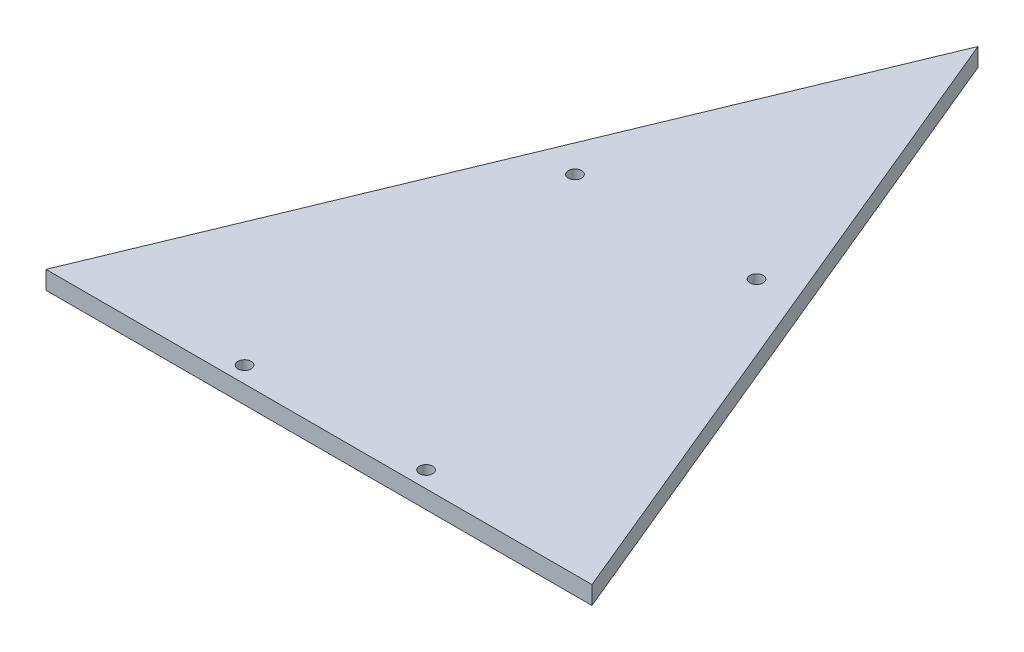
ISO-10303-21;
HEADER;
FILE_DESCRIPTION(('STEP AP214'),'2;1');
FILE_NAME('part.step','',(''),(''),'','','');
FILE_SCHEMA(('AUTOMOTIVE_DESIGN { 1 0 10303 214 1 1 1 1 }'));
ENDSEC;
DATA;
#1=APPLICATION_CONTEXT('core data for automotive mechanical design processes');
#2=APPLICATION_PROTOCOL_DEFINITION('international standard','automotive_design',2000,#1);
#3=PRODUCT_CONTEXT('',#1,'mechanical');
#4=PRODUCT('Part','Part','',(#3));
#5=PRODUCT_RELATED_PRODUCT_CATEGORY('part','',(#4));
#6=PRODUCT_DEFINITION_FORMATION('','',#4);
#7=PRODUCT_DEFINITION_CONTEXT('part definition',#1,'design');
#8=PRODUCT_DEFINITION('design','',#6,#7);
#9=PRODUCT_DEFINITION_SHAPE('','',#8);
#10=(LENGTH_UNIT() NAMED_UNIT(*) SI_UNIT(.MILLI.,.METRE.));
#11=(NAMED_UNIT(*) PLANE_ANGLE_UNIT() SI_UNIT($,.RADIAN.));
#12=(NAMED_UNIT(*) SI_UNIT($,.STERADIAN.) SOLID_ANGLE_UNIT());
#13=UNCERTAINTY_MEASURE_WITH_UNIT(LENGTH_MEASURE(1.E-05),#10,'distance_accuracy_value','');
#14=(GEOMETRIC_REPRESENTATION_CONTEXT(3) GLOBAL_UNCERTAINTY_ASSIGNED_CONTEXT((#13)) GLOBAL_UNIT_ASSIGNED_CONTEXT((#10,
#11,#12)) REPRESENTATION_CONTEXT('',''));
#15=CARTESIAN_POINT('',(0.,0.,0.));
#16=DIRECTION('',(0.,0.,1.));
#17=DIRECTION('',(1.,0.,0.));
#18=AXIS2_PLACEMENT_3D('',#15,#16,#17);
#19=CARTESIAN_POINT('',(0.,5.,0.));
#20=DIRECTION('',(0.,0.,1.));
#21=DIRECTION('',(1.,0.,0.));
#22=AXIS2_PLACEMENT_3D('',#19,#20,#21);
#23=PLANE('',#22);
#24=DIRECTION('',(-1.,0.,0.));
#25=VECTOR('',#24,1.);
#26=CARTESIAN_POINT('',(0.,0.,0.));
#27=LINE('',#26,#25);
#28=CARTESIAN_POINT('',(75.1797615707155,0.,0.));
#29=VERTEX_POINT('',#28);
#30=CARTESIAN_POINT('',(-75.1797615707155,0.,0.));
#31=VERTEX_POINT('',#30);
#32=EDGE_CURVE('E83',#29,#31,#27,.T.);
#33=ORIENTED_EDGE('',*,*,#32,.F.);
#34=DIRECTION('',(0.,-1.,0.));
#35=VECTOR('',#34,1.);
#36=CARTESIAN_POINT('',(75.1797615707155,5.,0.));
#37=LINE('',#36,#35);
#38=CARTESIAN_POINT('',(75.1797615707155,5.,0.));
#39=VERTEX_POINT('',#38);
#40=EDGE_CURVE('E11',#39,#29,#37,.T.);
#41=ORIENTED_EDGE('',*,*,#40,.F.);
#42=DIRECTION('',(-1.,0.,0.));
#43=VECTOR('',#42,1.);
#44=CARTESIAN_POINT('',(0.,5.,0.));
#45=LINE('',#44,#43);
#46=CARTESIAN_POINT('',(-75.1797615707155,5.,0.));
#47=VERTEX_POINT('',#46);
#48=EDGE_CURVE('E81',#39,#47,#45,.T.);
#49=ORIENTED_EDGE('',*,*,#48,.T.);
#50=DIRECTION('',(0.,-1.,0.));
#51=VECTOR('',#50,1.);
#52=CARTESIAN_POINT('',(-75.1797615707155,5.,0.));
#53=LINE('',#52,#51);
#54=EDGE_CURVE('E63',#47,#31,#53,.T.);
#55=ORIENTED_EDGE('',*,*,#54,.T.);
#56=EDGE_LOOP('',(#33,#41,#49,#55));
#57=FACE_BOUND('',#56,.T.);
#58=ADVANCED_FACE('F44',(#57),#23,.T.);
#59=CARTESIAN_POINT('',(64.1699403926784,5.,-26.58005960732));
#60=DIRECTION('',(-0.923879532511289,0.,0.382683432365084));
#61=DIRECTION('',(0.382683432365084,0.,0.923879532511289));
#62=AXIS2_PLACEMENT_3D('',#59,#60,#61);
#63=PLANE('',#62);
#64=DIRECTION('',(-0.382683432365084,0.,-0.923879532511289));
#65=VECTOR('',#64,1.);
#66=CARTESIAN_POINT('',(64.1699403926784,0.,-26.58005960732));
#67=LINE('',#66,#65);
#68=CARTESIAN_POINT('',(0.,0.,-181.5));
#69=VERTEX_POINT('',#68);
#70=EDGE_CURVE('E99',#29,#69,#67,.T.);
#71=ORIENTED_EDGE('',*,*,#70,.T.);
#72=DIRECTION('',(0.,-1.,0.));
#73=VECTOR('',#72,1.);
#74=CARTESIAN_POINT('',(0.,5.,-181.5));
#75=LINE('',#74,#73);
#76=CARTESIAN_POINT('',(0.,5.,-181.5));
#77=VERTEX_POINT('',#76);
#78=EDGE_CURVE('E54',#77,#69,#75,.T.);
#79=ORIENTED_EDGE('',*,*,#78,.F.);
#80=DIRECTION('',(-0.382683432365084,0.,-0.923879532511289));
#81=VECTOR('',#80,1.);
#82=CARTESIAN_POINT('',(64.1699403926784,5.,-26.58005960732));
#83=LINE('',#82,#81);
#84=EDGE_CURVE('E86',#39,#77,#83,.T.);
#85=ORIENTED_EDGE('',*,*,#84,.F.);
#86=ORIENTED_EDGE('',*,*,#40,.T.);
#87=EDGE_LOOP('',(#71,#79,#85,#86));
#88=FACE_BOUND('',#87,.T.);
#89=ADVANCED_FACE('F87',(#88),#63,.F.);
#90=CARTESIAN_POINT('',(-64.1699403926784,5.,-26.58005960732));
#91=DIRECTION('',(-0.923879532511289,0.,-0.382683432365084));
#92=DIRECTION('',(-0.382683432365084,0.,0.923879532511289));
#93=AXIS2_PLACEMENT_3D('',#90,#91,#92);
#94=PLANE('',#93);
#95=DIRECTION('',(0.382683432365084,0.,-0.923879532511289));
#96=VECTOR('',#95,1.);
#97=CARTESIAN_POINT('',(-64.1699403926784,0.,-26.58005960732));
#98=LINE('',#97,#96);
#99=EDGE_CURVE('E94',#31,#69,#98,.T.);
#100=ORIENTED_EDGE('',*,*,#99,.F.);
#101=ORIENTED_EDGE('',*,*,#54,.F.);
#102=DIRECTION('',(0.382683432365084,0.,-0.923879532511289));
#103=VECTOR('',#102,1.);
#104=CARTESIAN_POINT('',(-64.1699403926784,5.,-26.58005960732));
#105=LINE('',#104,#103);
#106=EDGE_CURVE('E90',#47,#77,#105,.T.);
#107=ORIENTED_EDGE('',*,*,#106,.T.);
#108=ORIENTED_EDGE('',*,*,#78,.T.);
#109=EDGE_LOOP('',(#100,#101,#107,#108));
#110=FACE_BOUND('',#109,.T.);
#111=ADVANCED_FACE('F152',(#110),#94,.T.);
#112=CARTESIAN_POINT('',(0.,5.,0.));
#113=DIRECTION('',(0.,1.,0.));
#114=DIRECTION('',(0.,0.,1.));
#115=AXIS2_PLACEMENT_3D('',#112,#113,#114);
#116=PLANE('',#115);
#117=CARTESIAN_POINT('',(-25.,5.,-4.49999999999999));
#118=DIRECTION('',(0.,1.,0.));
#119=DIRECTION('',(0.,0.,1.));
#120=AXIS2_PLACEMENT_3D('',#117,#118,#119);
#121=CIRCLE('',#120,1.82500000000001);
#122=CARTESIAN_POINT('',(-25.,5.,-2.67499999999999));
#123=VERTEX_POINT('',#122);
#124=EDGE_CURVE('E178',#123,#123,#121,.T.);
#125=ORIENTED_EDGE('',*,*,#124,.F.);
#126=EDGE_LOOP('',(#125));
#127=FACE_BOUND('',#126,.T.);
#128=CARTESIAN_POINT('',(25.,5.,-95.5));
#129=DIRECTION('',(0.,1.,0.));
#130=DIRECTION('',(0.,0.,1.));
#131=AXIS2_PLACEMENT_3D('',#128,#129,#130);
#132=CIRCLE('',#131,1.82499999999999);
#133=CARTESIAN_POINT('',(25.,5.,-93.675));
#134=VERTEX_POINT('',#133);
#135=EDGE_CURVE('E181',#134,#134,#132,.T.);
#136=ORIENTED_EDGE('',*,*,#135,.F.);
#137=EDGE_LOOP('',(#136));
#138=FACE_BOUND('',#137,.T.);
#139=CARTESIAN_POINT('',(-25.,5.,-95.5));
#140=DIRECTION('',(0.,1.,0.));
#141=DIRECTION('',(0.,0.,1.));
#142=AXIS2_PLACEMENT_3D('',#139,#140,#141);
#143=CIRCLE('',#142,1.82500000000001);
#144=CARTESIAN_POINT('',(-25.,5.,-93.675));
#145=VERTEX_POINT('',#144);
#146=EDGE_CURVE('E187',#145,#145,#143,.T.);
#147=ORIENTED_EDGE('',*,*,#146,.F.);
#148=EDGE_LOOP('',(#147));
#149=FACE_BOUND('',#148,.T.);
#150=CARTESIAN_POINT('',(25.,5.,-4.49999999999999));
#151=DIRECTION('',(0.,1.,0.));
#152=DIRECTION('',(0.,0.,1.));
#153=AXIS2_PLACEMENT_3D('',#150,#151,#152);
#154=CIRCLE('',#153,1.82499999999999);
#155=CARTESIAN_POINT('',(25.,5.,-2.675));
#156=VERTEX_POINT('',#155);
#157=EDGE_CURVE('E102',#156,#156,#154,.T.);
#158=ORIENTED_EDGE('',*,*,#157,.F.);
#159=EDGE_LOOP('',(#158));
#160=FACE_BOUND('',#159,.T.);
#161=ORIENTED_EDGE('',*,*,#48,.F.);
#162=ORIENTED_EDGE('',*,*,#84,.T.);
#163=ORIENTED_EDGE('',*,*,#106,.F.);
#164=EDGE_LOOP('',(#161,#162,#163));
#165=FACE_BOUND('',#164,.T.);
#166=ADVANCED_FACE('F92',(#127,#138,#149,#160,#165),#116,.T.);
#167=CARTESIAN_POINT('',(0.,0.,0.));
#168=DIRECTION('',(0.,1.,0.));
#169=DIRECTION('',(0.,0.,1.));
#170=AXIS2_PLACEMENT_3D('',#167,#168,#169);
#171=PLANE('',#170);
#172=CARTESIAN_POINT('',(-25.,0.,-4.49999999999999));
#173=DIRECTION('',(0.,1.,0.));
#174=DIRECTION('',(0.,0.,1.));
#175=AXIS2_PLACEMENT_3D('',#172,#173,#174);
#176=CIRCLE('',#175,1.82500000000001);
#177=CARTESIAN_POINT('',(-25.,0.,-2.67499999999999));
#178=VERTEX_POINT('',#177);
#179=EDGE_CURVE('E47',#178,#178,#176,.T.);
#180=ORIENTED_EDGE('',*,*,#179,.T.);
#181=EDGE_LOOP('',(#180));
#182=FACE_BOUND('',#181,.T.);
#183=CARTESIAN_POINT('',(25.,0.,-95.5));
#184=DIRECTION('',(0.,1.,0.));
#185=DIRECTION('',(0.,0.,1.));
#186=AXIS2_PLACEMENT_3D('',#183,#184,#185);
#187=CIRCLE('',#186,1.82499999999999);
#188=CARTESIAN_POINT('',(25.,0.,-93.675));
#189=VERTEX_POINT('',#188);
#190=EDGE_CURVE('E122',#189,#189,#187,.T.);
#191=ORIENTED_EDGE('',*,*,#190,.T.);
#192=EDGE_LOOP('',(#191));
#193=FACE_BOUND('',#192,.T.);
#194=CARTESIAN_POINT('',(-25.,0.,-95.5));
#195=DIRECTION('',(0.,1.,0.));
#196=DIRECTION('',(0.,0.,1.));
#197=AXIS2_PLACEMENT_3D('',#194,#195,#196);
#198=CIRCLE('',#197,1.82500000000001);
#199=CARTESIAN_POINT('',(-25.,0.,-93.675));
#200=VERTEX_POINT('',#199);
#201=EDGE_CURVE('E119',#200,#200,#198,.T.);
#202=ORIENTED_EDGE('',*,*,#201,.T.);
#203=EDGE_LOOP('',(#202));
#204=FACE_BOUND('',#203,.T.);
#205=CARTESIAN_POINT('',(25.,0.,-4.49999999999999));
#206=DIRECTION('',(0.,1.,0.));
#207=DIRECTION('',(0.,0.,1.));
#208=AXIS2_PLACEMENT_3D('',#205,#206,#207);
#209=CIRCLE('',#208,1.82499999999999);
#210=CARTESIAN_POINT('',(25.,0.,-2.675));
#211=VERTEX_POINT('',#210);
#212=EDGE_CURVE('E115',#211,#211,#209,.T.);
#213=ORIENTED_EDGE('',*,*,#212,.T.);
#214=EDGE_LOOP('',(#213));
#215=FACE_BOUND('',#214,.T.);
#216=ORIENTED_EDGE('',*,*,#32,.T.);
#217=ORIENTED_EDGE('',*,*,#99,.T.);
#218=ORIENTED_EDGE('',*,*,#70,.F.);
#219=EDGE_LOOP('',(#216,#217,#218));
#220=FACE_BOUND('',#219,.T.);
#221=ADVANCED_FACE('F133',(#182,#193,#204,#215,#220),#171,.F.);
#222=CARTESIAN_POINT('',(25.,-5.,-4.49999999999999));
#223=DIRECTION('',(0.,1.,0.));
#224=DIRECTION('',(0.,0.,1.));
#225=AXIS2_PLACEMENT_3D('',#222,#223,#224);
#226=CYLINDRICAL_SURFACE('',#225,1.82499999999999);
#227=ORIENTED_EDGE('',*,*,#157,.T.);
#228=EDGE_LOOP('',(#227));
#229=FACE_BOUND('',#228,.T.);
#230=ORIENTED_EDGE('',*,*,#212,.F.);
#231=EDGE_LOOP('',(#230));
#232=FACE_BOUND('',#231,.T.);
#233=ADVANCED_FACE('F160',(#229,#232),#226,.F.);
#234=CARTESIAN_POINT('',(-25.,-5.,-95.5));
#235=DIRECTION('',(0.,1.,0.));
#236=DIRECTION('',(0.,0.,1.));
#237=AXIS2_PLACEMENT_3D('',#234,#235,#236);
#238=CYLINDRICAL_SURFACE('',#237,1.82500000000001);
#239=ORIENTED_EDGE('',*,*,#146,.T.);
#240=EDGE_LOOP('',(#239));
#241=FACE_BOUND('',#240,.T.);
#242=ORIENTED_EDGE('',*,*,#201,.F.);
#243=EDGE_LOOP('',(#242));
#244=FACE_BOUND('',#243,.T.);
#245=ADVANCED_FACE('F143',(#241,#244),#238,.F.);
#246=CARTESIAN_POINT('',(25.,-5.,-95.5));
#247=DIRECTION('',(0.,1.,0.));
#248=DIRECTION('',(0.,0.,1.));
#249=AXIS2_PLACEMENT_3D('',#246,#247,#248);
#250=CYLINDRICAL_SURFACE('',#249,1.82499999999999);
#251=ORIENTED_EDGE('',*,*,#135,.T.);
#252=EDGE_LOOP('',(#251));
#253=FACE_BOUND('',#252,.T.);
#254=ORIENTED_EDGE('',*,*,#190,.F.);
#255=EDGE_LOOP('',(#254));
#256=FACE_BOUND('',#255,.T.);
#257=ADVANCED_FACE('F137',(#253,#256),#250,.F.);
#258=CARTESIAN_POINT('',(-25.,-5.,-4.49999999999999));
#259=DIRECTION('',(0.,1.,0.));
#260=DIRECTION('',(0.,0.,1.));
#261=AXIS2_PLACEMENT_3D('',#258,#259,#260);
#262=CYLINDRICAL_SURFACE('',#261,1.82500000000001);
#263=ORIENTED_EDGE('',*,*,#124,.T.);
#264=EDGE_LOOP('',(#263));
#265=FACE_BOUND('',#264,.T.);
#266=ORIENTED_EDGE('',*,*,#179,.F.);
#267=EDGE_LOOP('',(#266));
#268=FACE_BOUND('',#267,.T.);
#269=ADVANCED_FACE('F135',(#265,#268),#262,.F.);
#270=CLOSED_SHELL('',(#58,#89,#111,#166,#221,#233,#245,#257,#269));
#271=MANIFOLD_SOLID_BREP('B2',#270);
#272=ADVANCED_BREP_SHAPE_REPRESENTATION('',(#18,#271),#14);
#273=SHAPE_DEFINITION_REPRESENTATION(#9,#272);
ENDSEC;
END-ISO-10303-21;
